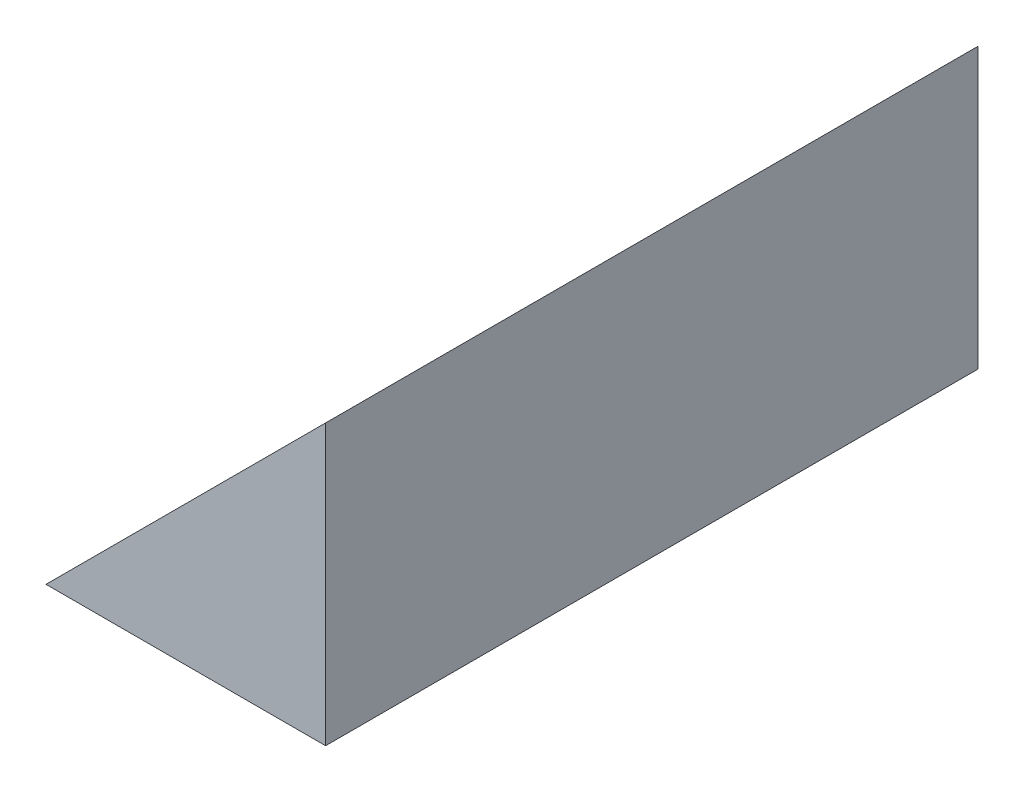
ISO-10303-21;
HEADER;
FILE_DESCRIPTION(('STEP AP214'),'2;1');
FILE_NAME('part.step','',(''),(''),'','','');
FILE_SCHEMA(('AUTOMOTIVE_DESIGN { 1 0 10303 214 1 1 1 1 }'));
ENDSEC;
DATA;
#1=APPLICATION_CONTEXT('core data for automotive mechanical design processes');
#2=APPLICATION_PROTOCOL_DEFINITION('international standard','automotive_design',2000,#1);
#3=PRODUCT_CONTEXT('',#1,'mechanical');
#4=PRODUCT('Part','Part','',(#3));
#5=PRODUCT_RELATED_PRODUCT_CATEGORY('part','',(#4));
#6=PRODUCT_DEFINITION_FORMATION('','',#4);
#7=PRODUCT_DEFINITION_CONTEXT('part definition',#1,'design');
#8=PRODUCT_DEFINITION('design','',#6,#7);
#9=PRODUCT_DEFINITION_SHAPE('','',#8);
#10=(LENGTH_UNIT() NAMED_UNIT(*) SI_UNIT(.MILLI.,.METRE.));
#11=(NAMED_UNIT(*) PLANE_ANGLE_UNIT() SI_UNIT($,.RADIAN.));
#12=(NAMED_UNIT(*) SI_UNIT($,.STERADIAN.) SOLID_ANGLE_UNIT());
#13=UNCERTAINTY_MEASURE_WITH_UNIT(LENGTH_MEASURE(1.E-05),#10,'distance_accuracy_value','');
#14=(GEOMETRIC_REPRESENTATION_CONTEXT(3) GLOBAL_UNCERTAINTY_ASSIGNED_CONTEXT((#13)) GLOBAL_UNIT_ASSIGNED_CONTEXT((#10,
#11,#12)) REPRESENTATION_CONTEXT('',''));
#15=CARTESIAN_POINT('',(0.,0.,0.));
#16=DIRECTION('',(0.,0.,1.));
#17=DIRECTION('',(1.,0.,0.));
#18=AXIS2_PLACEMENT_3D('',#15,#16,#17);
#19=CARTESIAN_POINT('',(0.,38.1,0.));
#20=DIRECTION('',(0.,0.,-1.));
#21=DIRECTION('',(-1.,0.,0.));
#22=AXIS2_PLACEMENT_3D('',#19,#20,#21);
#23=PLANE('',#22);
#24=DIRECTION('',(0.,-1.,0.));
#25=VECTOR('',#24,1.);
#26=CARTESIAN_POINT('',(38.1,38.1,0.));
#27=LINE('',#26,#25);
#28=CARTESIAN_POINT('',(38.1,38.1,0.));
#29=VERTEX_POINT('',#28);
#30=CARTESIAN_POINT('',(38.1,0.,0.));
#31=VERTEX_POINT('',#30);
#32=EDGE_CURVE('E11',#29,#31,#27,.T.);
#33=ORIENTED_EDGE('',*,*,#32,.F.);
#34=DIRECTION('',(0.707106781186547,0.707106781186547,0.));
#35=VECTOR('',#34,1.);
#36=CARTESIAN_POINT('',(0.,0.,0.));
#37=LINE('',#36,#35);
#38=CARTESIAN_POINT('',(0.,0.,0.));
#39=VERTEX_POINT('',#38);
#40=EDGE_CURVE('E74',#39,#29,#37,.T.);
#41=ORIENTED_EDGE('',*,*,#40,.F.);
#42=DIRECTION('',(1.,0.,0.));
#43=VECTOR('',#42,1.);
#44=CARTESIAN_POINT('',(0.,0.,0.));
#45=LINE('',#44,#43);
#46=EDGE_CURVE('E88',#39,#31,#45,.T.);
#47=ORIENTED_EDGE('',*,*,#46,.T.);
#48=EDGE_LOOP('',(#33,#41,#47));
#49=FACE_BOUND('',#48,.T.);
#50=ADVANCED_FACE('F38',(#49),#23,.F.);
#51=CARTESIAN_POINT('',(38.1,38.1,0.));
#52=DIRECTION('',(-1.,0.,0.));
#53=DIRECTION('',(0.,0.,1.));
#54=AXIS2_PLACEMENT_3D('',#51,#52,#53);
#55=PLANE('',#54);
#56=DIRECTION('',(0.,0.,-1.));
#57=VECTOR('',#56,1.);
#58=CARTESIAN_POINT('',(38.1,0.,0.));
#59=LINE('',#58,#57);
#60=CARTESIAN_POINT('',(38.1,0.,-88.9));
#61=VERTEX_POINT('',#60);
#62=EDGE_CURVE('E59',#31,#61,#59,.T.);
#63=ORIENTED_EDGE('',*,*,#62,.T.);
#64=DIRECTION('',(0.,-1.,0.));
#65=VECTOR('',#64,1.);
#66=CARTESIAN_POINT('',(38.1,38.1,-88.9));
#67=LINE('',#66,#65);
#68=CARTESIAN_POINT('',(38.1,38.1,-88.9));
#69=VERTEX_POINT('',#68);
#70=EDGE_CURVE('E45',#69,#61,#67,.T.);
#71=ORIENTED_EDGE('',*,*,#70,.F.);
#72=DIRECTION('',(0.,0.,-1.));
#73=VECTOR('',#72,1.);
#74=CARTESIAN_POINT('',(38.1,38.1,0.));
#75=LINE('',#74,#73);
#76=EDGE_CURVE('E71',#29,#69,#75,.T.);
#77=ORIENTED_EDGE('',*,*,#76,.F.);
#78=ORIENTED_EDGE('',*,*,#32,.T.);
#79=EDGE_LOOP('',(#63,#71,#77,#78));
#80=FACE_BOUND('',#79,.T.);
#81=ADVANCED_FACE('F84',(#80),#55,.F.);
#82=CARTESIAN_POINT('',(0.,38.1,-88.9));
#83=DIRECTION('',(0.,0.,1.));
#84=DIRECTION('',(1.,0.,0.));
#85=AXIS2_PLACEMENT_3D('',#82,#83,#84);
#86=PLANE('',#85);
#87=DIRECTION('',(-1.,0.,0.));
#88=VECTOR('',#87,1.);
#89=CARTESIAN_POINT('',(0.,0.,-88.9));
#90=LINE('',#89,#88);
#91=CARTESIAN_POINT('',(0.,0.,-88.9));
#92=VERTEX_POINT('',#91);
#93=EDGE_CURVE('E76',#61,#92,#90,.T.);
#94=ORIENTED_EDGE('',*,*,#93,.T.);
#95=DIRECTION('',(0.707106781186547,0.707106781186547,0.));
#96=VECTOR('',#95,1.);
#97=CARTESIAN_POINT('',(0.,0.,-88.9));
#98=LINE('',#97,#96);
#99=EDGE_CURVE('E52',#92,#69,#98,.T.);
#100=ORIENTED_EDGE('',*,*,#99,.T.);
#101=ORIENTED_EDGE('',*,*,#70,.T.);
#102=EDGE_LOOP('',(#94,#100,#101));
#103=FACE_BOUND('',#102,.T.);
#104=ADVANCED_FACE('F79',(#103),#86,.F.);
#105=CARTESIAN_POINT('',(0.,0.,0.));
#106=DIRECTION('',(0.,-1.,0.));
#107=DIRECTION('',(0.,0.,-1.));
#108=AXIS2_PLACEMENT_3D('',#105,#106,#107);
#109=PLANE('',#108);
#110=DIRECTION('',(0.,0.,1.));
#111=VECTOR('',#110,1.);
#112=CARTESIAN_POINT('',(0.,0.,0.));
#113=LINE('',#112,#111);
#114=EDGE_CURVE('E82',#92,#39,#113,.T.);
#115=ORIENTED_EDGE('',*,*,#114,.F.);
#116=ORIENTED_EDGE('',*,*,#93,.F.);
#117=ORIENTED_EDGE('',*,*,#62,.F.);
#118=ORIENTED_EDGE('',*,*,#46,.F.);
#119=EDGE_LOOP('',(#115,#116,#117,#118));
#120=FACE_BOUND('',#119,.T.);
#121=ADVANCED_FACE('F94',(#120),#109,.T.);
#122=CARTESIAN_POINT('',(0.,0.,-88.9));
#123=DIRECTION('',(0.707106781186547,-0.707106781186547,0.));
#124=DIRECTION('',(0.707106781186548,0.707106781186548,0.));
#125=AXIS2_PLACEMENT_3D('',#122,#123,#124);
#126=PLANE('',#125);
#127=ORIENTED_EDGE('',*,*,#40,.T.);
#128=ORIENTED_EDGE('',*,*,#76,.T.);
#129=ORIENTED_EDGE('',*,*,#99,.F.);
#130=ORIENTED_EDGE('',*,*,#114,.T.);
#131=EDGE_LOOP('',(#127,#128,#129,#130));
#132=FACE_BOUND('',#131,.T.);
#133=ADVANCED_FACE('F72',(#132),#126,.F.);
#134=CLOSED_SHELL('',(#50,#81,#104,#121,#133));
#135=MANIFOLD_SOLID_BREP('B2',#134);
#136=ADVANCED_BREP_SHAPE_REPRESENTATION('',(#18,#135),#14);
#137=SHAPE_DEFINITION_REPRESENTATION(#9,#136);
ENDSEC;
END-ISO-10303-21;
